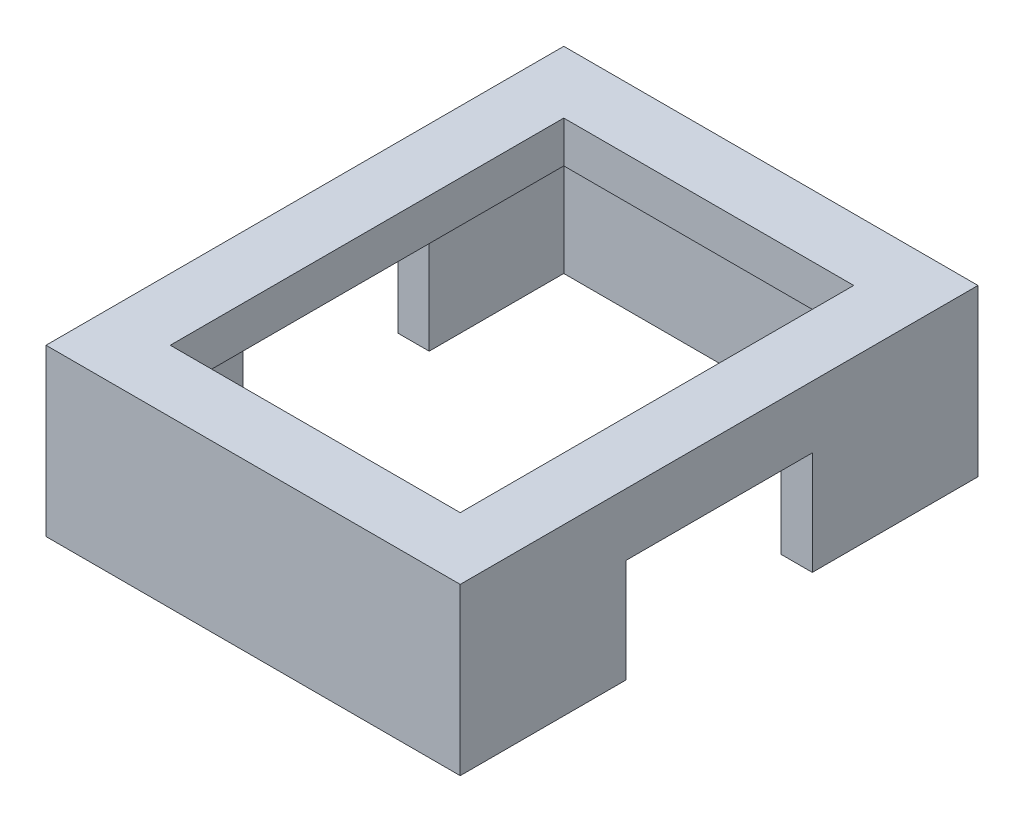
ISO-10303-21;
HEADER;
FILE_DESCRIPTION(('STEP AP214'),'2;1');
FILE_NAME('part.step','',(''),(''),'','','');
FILE_SCHEMA(('AUTOMOTIVE_DESIGN { 1 0 10303 214 1 1 1 1 }'));
ENDSEC;
DATA;
#1=APPLICATION_CONTEXT('core data for automotive mechanical design processes');
#2=APPLICATION_PROTOCOL_DEFINITION('international standard','automotive_design',2000,#1);
#3=PRODUCT_CONTEXT('',#1,'mechanical');
#4=PRODUCT('Part','Part','',(#3));
#5=PRODUCT_RELATED_PRODUCT_CATEGORY('part','',(#4));
#6=PRODUCT_DEFINITION_FORMATION('','',#4);
#7=PRODUCT_DEFINITION_CONTEXT('part definition',#1,'design');
#8=PRODUCT_DEFINITION('design','',#6,#7);
#9=PRODUCT_DEFINITION_SHAPE('','',#8);
#10=(LENGTH_UNIT() NAMED_UNIT(*) SI_UNIT(.MILLI.,.METRE.));
#11=(NAMED_UNIT(*) PLANE_ANGLE_UNIT() SI_UNIT($,.RADIAN.));
#12=(NAMED_UNIT(*) SI_UNIT($,.STERADIAN.) SOLID_ANGLE_UNIT());
#13=UNCERTAINTY_MEASURE_WITH_UNIT(LENGTH_MEASURE(1.E-05),#10,'distance_accuracy_value','');
#14=(GEOMETRIC_REPRESENTATION_CONTEXT(3) GLOBAL_UNCERTAINTY_ASSIGNED_CONTEXT((#13)) GLOBAL_UNIT_ASSIGNED_CONTEXT((#10,
#11,#12)) REPRESENTATION_CONTEXT('',''));
#15=CARTESIAN_POINT('',(0.,0.,0.));
#16=DIRECTION('',(0.,0.,1.));
#17=DIRECTION('',(1.,0.,0.));
#18=AXIS2_PLACEMENT_3D('',#15,#16,#17);
#19=CARTESIAN_POINT('',(10.0967741935484,5.,-1.87096774193549));
#20=DIRECTION('',(0.,1.,0.));
#21=DIRECTION('',(0.,0.,1.));
#22=AXIS2_PLACEMENT_3D('',#19,#20,#21);
#23=PLANE('',#22);
#24=DIRECTION('',(-1.,0.,0.));
#25=VECTOR('',#24,1.);
#26=CARTESIAN_POINT('',(10.0967741935484,5.,7.12903225806451));
#27=LINE('',#26,#25);
#28=CARTESIAN_POINT('',(-0.903225806451616,5.,7.12903225806451));
#29=VERTEX_POINT('',#28);
#30=CARTESIAN_POINT('',(-2.40322580645161,5.,7.12903225806451));
#31=VERTEX_POINT('',#30);
#32=EDGE_CURVE('E292',#29,#31,#27,.T.);
#33=ORIENTED_EDGE('',*,*,#32,.T.);
#34=DIRECTION('',(0.,0.,-1.));
#35=VECTOR('',#34,1.);
#36=CARTESIAN_POINT('',(-2.40322580645161,5.,-1.87096774193549));
#37=LINE('',#36,#35);
#38=CARTESIAN_POINT('',(-2.40322580645161,5.,-1.87096774193549));
#39=VERTEX_POINT('',#38);
#40=EDGE_CURVE('E265',#31,#39,#37,.T.);
#41=ORIENTED_EDGE('',*,*,#40,.T.);
#42=DIRECTION('',(-1.,0.,0.));
#43=VECTOR('',#42,1.);
#44=CARTESIAN_POINT('',(10.0967741935484,5.,-1.87096774193549));
#45=LINE('',#44,#43);
#46=CARTESIAN_POINT('',(-0.903225806451616,5.,-1.87096774193549));
#47=VERTEX_POINT('',#46);
#48=EDGE_CURVE('E286',#47,#39,#45,.T.);
#49=ORIENTED_EDGE('',*,*,#48,.F.);
#50=DIRECTION('',(0.,0.,-1.));
#51=VECTOR('',#50,1.);
#52=CARTESIAN_POINT('',(-0.903225806451618,5.,-9.87096774193548));
#53=LINE('',#52,#51);
#54=EDGE_CURVE('E358',#29,#47,#53,.T.);
#55=ORIENTED_EDGE('',*,*,#54,.F.);
#56=EDGE_LOOP('',(#33,#41,#49,#55));
#57=FACE_BOUND('',#56,.T.);
#58=ADVANCED_FACE('F39',(#57),#23,.F.);
#59=CARTESIAN_POINT('',(10.0967741935484,5.,-1.87096774193549));
#60=DIRECTION('',(0.,0.,-1.));
#61=DIRECTION('',(-1.,0.,0.));
#62=AXIS2_PLACEMENT_3D('',#59,#60,#61);
#63=PLANE('',#62);
#64=ORIENTED_EDGE('',*,*,#48,.T.);
#65=DIRECTION('',(0.,-1.,0.));
#66=VECTOR('',#65,1.);
#67=CARTESIAN_POINT('',(-2.40322580645161,5.,-1.87096774193549));
#68=LINE('',#67,#66);
#69=CARTESIAN_POINT('',(-2.40322580645161,0.,-1.87096774193548));
#70=VERTEX_POINT('',#69);
#71=EDGE_CURVE('E269',#39,#70,#68,.T.);
#72=ORIENTED_EDGE('',*,*,#71,.T.);
#73=DIRECTION('',(-1.,0.,0.));
#74=VECTOR('',#73,1.);
#75=CARTESIAN_POINT('',(0.,0.,-1.87096774193549));
#76=LINE('',#75,#74);
#77=CARTESIAN_POINT('',(-0.903225806451614,0.,-1.87096774193549));
#78=VERTEX_POINT('',#77);
#79=EDGE_CURVE('E354',#78,#70,#76,.T.);
#80=ORIENTED_EDGE('',*,*,#79,.F.);
#81=DIRECTION('',(0.,-1.,0.));
#82=VECTOR('',#81,1.);
#83=CARTESIAN_POINT('',(-0.903225806451617,8.,-1.87096774193548));
#84=LINE('',#83,#82);
#85=EDGE_CURVE('E299',#47,#78,#84,.T.);
#86=ORIENTED_EDGE('',*,*,#85,.F.);
#87=EDGE_LOOP('',(#64,#72,#80,#86));
#88=FACE_BOUND('',#87,.T.);
#89=ADVANCED_FACE('F396',(#88),#63,.F.);
#90=CARTESIAN_POINT('',(10.0967741935484,5.,7.12903225806451));
#91=DIRECTION('',(0.,0.,1.));
#92=DIRECTION('',(0.,-1.,0.));
#93=AXIS2_PLACEMENT_3D('',#90,#91,#92);
#94=PLANE('',#93);
#95=DIRECTION('',(1.,0.,0.));
#96=VECTOR('',#95,1.);
#97=CARTESIAN_POINT('',(0.,0.,7.12903225806451));
#98=LINE('',#97,#96);
#99=CARTESIAN_POINT('',(-2.40322580645161,0.,7.12903225806451));
#100=VERTEX_POINT('',#99);
#101=CARTESIAN_POINT('',(-0.903225806451616,0.,7.12903225806451));
#102=VERTEX_POINT('',#101);
#103=EDGE_CURVE('E348',#100,#102,#98,.T.);
#104=ORIENTED_EDGE('',*,*,#103,.F.);
#105=DIRECTION('',(0.,1.,0.));
#106=VECTOR('',#105,1.);
#107=CARTESIAN_POINT('',(-2.40322580645161,5.,7.12903225806451));
#108=LINE('',#107,#106);
#109=EDGE_CURVE('E366',#100,#31,#108,.T.);
#110=ORIENTED_EDGE('',*,*,#109,.T.);
#111=ORIENTED_EDGE('',*,*,#32,.F.);
#112=DIRECTION('',(0.,1.,0.));
#113=VECTOR('',#112,1.);
#114=CARTESIAN_POINT('',(-0.903225806451616,7.99999999999999,7.12903225806451));
#115=LINE('',#114,#113);
#116=EDGE_CURVE('E290',#102,#29,#115,.T.);
#117=ORIENTED_EDGE('',*,*,#116,.F.);
#118=EDGE_LOOP('',(#104,#110,#111,#117));
#119=FACE_BOUND('',#118,.T.);
#120=ADVANCED_FACE('F403',(#119),#94,.F.);
#121=CARTESIAN_POINT('',(0.,0.,0.));
#122=DIRECTION('',(0.,1.,0.));
#123=DIRECTION('',(0.,0.,1.));
#124=AXIS2_PLACEMENT_3D('',#121,#122,#123);
#125=PLANE('',#124);
#126=ORIENTED_EDGE('',*,*,#79,.T.);
#127=DIRECTION('',(0.,0.,1.));
#128=VECTOR('',#127,1.);
#129=CARTESIAN_POINT('',(-2.40322580645161,0.,-8.37096774193548));
#130=LINE('',#129,#128);
#131=CARTESIAN_POINT('',(-2.40322580645161,0.,-8.37096774193548));
#132=VERTEX_POINT('',#131);
#133=EDGE_CURVE('E230',#132,#70,#130,.T.);
#134=ORIENTED_EDGE('',*,*,#133,.F.);
#135=DIRECTION('',(1.,0.,0.));
#136=VECTOR('',#135,1.);
#137=CARTESIAN_POINT('',(-2.40322580645161,0.,-8.37096774193548));
#138=LINE('',#137,#136);
#139=CARTESIAN_POINT('',(-19.4032258064516,0.,-8.37096774193549));
#140=VERTEX_POINT('',#139);
#141=EDGE_CURVE('E217',#140,#132,#138,.T.);
#142=ORIENTED_EDGE('',*,*,#141,.F.);
#143=DIRECTION('',(0.,0.,-1.));
#144=VECTOR('',#143,1.);
#145=CARTESIAN_POINT('',(-19.4032258064516,0.,-8.37096774193549));
#146=LINE('',#145,#144);
#147=CARTESIAN_POINT('',(-19.4032258064516,0.,-1.87096774193548));
#148=VERTEX_POINT('',#147);
#149=EDGE_CURVE('E237',#148,#140,#146,.T.);
#150=ORIENTED_EDGE('',*,*,#149,.F.);
#151=CARTESIAN_POINT('',(-20.9032258064516,0.,-1.87096774193548));
#152=VERTEX_POINT('',#151);
#153=EDGE_CURVE('E353',#148,#152,#76,.T.);
#154=ORIENTED_EDGE('',*,*,#153,.T.);
#155=DIRECTION('',(0.,0.,1.));
#156=VECTOR('',#155,1.);
#157=CARTESIAN_POINT('',(-20.9032258064516,0.,-9.87096774193548));
#158=LINE('',#157,#156);
#159=CARTESIAN_POINT('',(-20.9032258064516,0.,-9.87096774193548));
#160=VERTEX_POINT('',#159);
#161=EDGE_CURVE('E319',#160,#152,#158,.T.);
#162=ORIENTED_EDGE('',*,*,#161,.F.);
#163=DIRECTION('',(-1.,0.,0.));
#164=VECTOR('',#163,1.);
#165=CARTESIAN_POINT('',(-20.9032258064516,0.,-9.87096774193548));
#166=LINE('',#165,#164);
#167=CARTESIAN_POINT('',(-0.903225806451618,0.,-9.87096774193548));
#168=VERTEX_POINT('',#167);
#169=EDGE_CURVE('E309',#168,#160,#166,.T.);
#170=ORIENTED_EDGE('',*,*,#169,.F.);
#171=DIRECTION('',(0.,0.,-1.));
#172=VECTOR('',#171,1.);
#173=CARTESIAN_POINT('',(-0.903225806451618,0.,-9.87096774193548));
#174=LINE('',#173,#172);
#175=EDGE_CURVE('E326',#78,#168,#174,.T.);
#176=ORIENTED_EDGE('',*,*,#175,.F.);
#177=EDGE_LOOP('',(#126,#134,#142,#150,#154,#162,#170,#176));
#178=FACE_BOUND('',#177,.T.);
#179=ADVANCED_FACE('F420',(#178),#125,.F.);
#180=CARTESIAN_POINT('',(-20.9032258064516,8.,-9.87096774193548));
#181=DIRECTION('',(1.,0.,0.));
#182=DIRECTION('',(0.,0.,-1.));
#183=AXIS2_PLACEMENT_3D('',#180,#181,#182);
#184=PLANE('',#183);
#185=ORIENTED_EDGE('',*,*,#161,.T.);
#186=DIRECTION('',(0.,-1.,0.));
#187=VECTOR('',#186,1.);
#188=CARTESIAN_POINT('',(-20.9032258064516,5.,-1.87096774193548));
#189=LINE('',#188,#187);
#190=CARTESIAN_POINT('',(-20.9032258064516,5.,-1.87096774193548));
#191=VERTEX_POINT('',#190);
#192=EDGE_CURVE('E273',#191,#152,#189,.T.);
#193=ORIENTED_EDGE('',*,*,#192,.F.);
#194=DIRECTION('',(0.,0.,-1.));
#195=VECTOR('',#194,1.);
#196=CARTESIAN_POINT('',(-20.9032258064516,5.,-1.87096774193548));
#197=LINE('',#196,#195);
#198=CARTESIAN_POINT('',(-20.9032258064516,5.,7.12903225806452));
#199=VERTEX_POINT('',#198);
#200=EDGE_CURVE('E281',#199,#191,#197,.T.);
#201=ORIENTED_EDGE('',*,*,#200,.F.);
#202=DIRECTION('',(0.,1.,0.));
#203=VECTOR('',#202,1.);
#204=CARTESIAN_POINT('',(-20.9032258064516,5.,7.12903225806452));
#205=LINE('',#204,#203);
#206=CARTESIAN_POINT('',(-20.9032258064516,0.,7.12903225806451));
#207=VERTEX_POINT('',#206);
#208=EDGE_CURVE('E277',#207,#199,#205,.T.);
#209=ORIENTED_EDGE('',*,*,#208,.F.);
#210=CARTESIAN_POINT('',(-20.9032258064516,0.,15.1290322580645));
#211=VERTEX_POINT('',#210);
#212=EDGE_CURVE('E303',#207,#211,#158,.T.);
#213=ORIENTED_EDGE('',*,*,#212,.T.);
#214=DIRECTION('',(0.,-1.,0.));
#215=VECTOR('',#214,1.);
#216=CARTESIAN_POINT('',(-20.9032258064516,8.,15.1290322580645));
#217=LINE('',#216,#215);
#218=CARTESIAN_POINT('',(-20.9032258064516,8.,15.1290322580645));
#219=VERTEX_POINT('',#218);
#220=EDGE_CURVE('E344',#219,#211,#217,.T.);
#221=ORIENTED_EDGE('',*,*,#220,.F.);
#222=DIRECTION('',(0.,0.,1.));
#223=VECTOR('',#222,1.);
#224=CARTESIAN_POINT('',(-20.9032258064516,8.,-9.87096774193548));
#225=LINE('',#224,#223);
#226=CARTESIAN_POINT('',(-20.9032258064516,8.,-9.87096774193548));
#227=VERTEX_POINT('',#226);
#228=EDGE_CURVE('E304',#227,#219,#225,.T.);
#229=ORIENTED_EDGE('',*,*,#228,.F.);
#230=DIRECTION('',(0.,-1.,0.));
#231=VECTOR('',#230,1.);
#232=CARTESIAN_POINT('',(-20.9032258064516,8.,-9.87096774193548));
#233=LINE('',#232,#231);
#234=EDGE_CURVE('E318',#227,#160,#233,.T.);
#235=ORIENTED_EDGE('',*,*,#234,.T.);
#236=EDGE_LOOP('',(#185,#193,#201,#209,#213,#221,#229,#235));
#237=FACE_BOUND('',#236,.T.);
#238=ADVANCED_FACE('F41',(#237),#184,.F.);
#239=CARTESIAN_POINT('',(-20.9032258064516,8.,15.1290322580645));
#240=DIRECTION('',(0.,0.,-1.));
#241=DIRECTION('',(-1.,0.,0.));
#242=AXIS2_PLACEMENT_3D('',#239,#240,#241);
#243=PLANE('',#242);
#244=DIRECTION('',(1.,0.,0.));
#245=VECTOR('',#244,1.);
#246=CARTESIAN_POINT('',(-20.9032258064516,0.,15.1290322580645));
#247=LINE('',#246,#245);
#248=CARTESIAN_POINT('',(-0.903225806451615,0.,15.1290322580645));
#249=VERTEX_POINT('',#248);
#250=EDGE_CURVE('E323',#211,#249,#247,.T.);
#251=ORIENTED_EDGE('',*,*,#250,.T.);
#252=DIRECTION('',(0.,-1.,0.));
#253=VECTOR('',#252,1.);
#254=CARTESIAN_POINT('',(-0.903225806451615,8.,15.1290322580645));
#255=LINE('',#254,#253);
#256=CARTESIAN_POINT('',(-0.903225806451615,8.,15.1290322580645));
#257=VERTEX_POINT('',#256);
#258=EDGE_CURVE('E340',#257,#249,#255,.T.);
#259=ORIENTED_EDGE('',*,*,#258,.F.);
#260=DIRECTION('',(1.,0.,0.));
#261=VECTOR('',#260,1.);
#262=CARTESIAN_POINT('',(-20.9032258064516,8.,15.1290322580645));
#263=LINE('',#262,#261);
#264=EDGE_CURVE('E308',#219,#257,#263,.T.);
#265=ORIENTED_EDGE('',*,*,#264,.F.);
#266=ORIENTED_EDGE('',*,*,#220,.T.);
#267=EDGE_LOOP('',(#251,#259,#265,#266));
#268=FACE_BOUND('',#267,.T.);
#269=ADVANCED_FACE('F459',(#268),#243,.F.);
#270=CARTESIAN_POINT('',(-0.903225806451618,8.,-9.87096774193548));
#271=DIRECTION('',(-1.,0.,0.));
#272=DIRECTION('',(0.,0.,1.));
#273=AXIS2_PLACEMENT_3D('',#270,#271,#272);
#274=PLANE('',#273);
#275=ORIENTED_EDGE('',*,*,#54,.T.);
#276=ORIENTED_EDGE('',*,*,#85,.T.);
#277=ORIENTED_EDGE('',*,*,#175,.T.);
#278=DIRECTION('',(0.,-1.,0.));
#279=VECTOR('',#278,1.);
#280=CARTESIAN_POINT('',(-0.903225806451618,8.,-9.87096774193548));
#281=LINE('',#280,#279);
#282=CARTESIAN_POINT('',(-0.903225806451618,8.,-9.87096774193548));
#283=VERTEX_POINT('',#282);
#284=EDGE_CURVE('E336',#283,#168,#281,.T.);
#285=ORIENTED_EDGE('',*,*,#284,.F.);
#286=DIRECTION('',(0.,0.,-1.));
#287=VECTOR('',#286,1.);
#288=CARTESIAN_POINT('',(-0.903225806451618,8.,-9.87096774193548));
#289=LINE('',#288,#287);
#290=EDGE_CURVE('E312',#257,#283,#289,.T.);
#291=ORIENTED_EDGE('',*,*,#290,.F.);
#292=ORIENTED_EDGE('',*,*,#258,.T.);
#293=EDGE_CURVE('E327',#249,#102,#174,.T.);
#294=ORIENTED_EDGE('',*,*,#293,.T.);
#295=ORIENTED_EDGE('',*,*,#116,.T.);
#296=EDGE_LOOP('',(#275,#276,#277,#285,#291,#292,#294,#295));
#297=FACE_BOUND('',#296,.T.);
#298=ADVANCED_FACE('F469',(#297),#274,.F.);
#299=CARTESIAN_POINT('',(-20.9032258064516,8.,-9.87096774193548));
#300=DIRECTION('',(0.,0.,1.));
#301=DIRECTION('',(1.,0.,0.));
#302=AXIS2_PLACEMENT_3D('',#299,#300,#301);
#303=PLANE('',#302);
#304=ORIENTED_EDGE('',*,*,#169,.T.);
#305=ORIENTED_EDGE('',*,*,#234,.F.);
#306=DIRECTION('',(-1.,0.,0.));
#307=VECTOR('',#306,1.);
#308=CARTESIAN_POINT('',(-20.9032258064516,8.,-9.87096774193548));
#309=LINE('',#308,#307);
#310=EDGE_CURVE('E315',#283,#227,#309,.T.);
#311=ORIENTED_EDGE('',*,*,#310,.F.);
#312=ORIENTED_EDGE('',*,*,#284,.T.);
#313=EDGE_LOOP('',(#304,#305,#311,#312));
#314=FACE_BOUND('',#313,.T.);
#315=ADVANCED_FACE('F466',(#314),#303,.F.);
#316=CARTESIAN_POINT('',(0.,8.,0.));
#317=DIRECTION('',(0.,1.,0.));
#318=DIRECTION('',(0.,0.,1.));
#319=AXIS2_PLACEMENT_3D('',#316,#317,#318);
#320=PLANE('',#319);
#321=DIRECTION('',(0.,0.,1.));
#322=VECTOR('',#321,1.);
#323=CARTESIAN_POINT('',(-17.9032258064516,8.,-6.87096774193548));
#324=LINE('',#323,#322);
#325=CARTESIAN_POINT('',(-17.9032258064516,8.,-6.87096774193548));
#326=VERTEX_POINT('',#325);
#327=CARTESIAN_POINT('',(-17.9032258064516,8.,12.1290322580645));
#328=VERTEX_POINT('',#327);
#329=EDGE_CURVE('E55',#326,#328,#324,.T.);
#330=ORIENTED_EDGE('',*,*,#329,.F.);
#331=DIRECTION('',(-1.,0.,0.));
#332=VECTOR('',#331,1.);
#333=CARTESIAN_POINT('',(-17.9032258064516,8.,-6.87096774193548));
#334=LINE('',#333,#332);
#335=CARTESIAN_POINT('',(-3.90322580645162,8.,-6.87096774193548));
#336=VERTEX_POINT('',#335);
#337=EDGE_CURVE('E197',#336,#326,#334,.T.);
#338=ORIENTED_EDGE('',*,*,#337,.F.);
#339=DIRECTION('',(0.,0.,-1.));
#340=VECTOR('',#339,1.);
#341=CARTESIAN_POINT('',(-3.90322580645162,8.,-6.87096774193548));
#342=LINE('',#341,#340);
#343=CARTESIAN_POINT('',(-3.90322580645161,8.,12.1290322580645));
#344=VERTEX_POINT('',#343);
#345=EDGE_CURVE('E179',#344,#336,#342,.T.);
#346=ORIENTED_EDGE('',*,*,#345,.F.);
#347=DIRECTION('',(1.,0.,0.));
#348=VECTOR('',#347,1.);
#349=CARTESIAN_POINT('',(-17.9032258064516,8.,12.1290322580645));
#350=LINE('',#349,#348);
#351=EDGE_CURVE('E189',#328,#344,#350,.T.);
#352=ORIENTED_EDGE('',*,*,#351,.F.);
#353=EDGE_LOOP('',(#330,#338,#346,#352));
#354=FACE_BOUND('',#353,.T.);
#355=ORIENTED_EDGE('',*,*,#228,.T.);
#356=ORIENTED_EDGE('',*,*,#264,.T.);
#357=ORIENTED_EDGE('',*,*,#290,.T.);
#358=ORIENTED_EDGE('',*,*,#310,.T.);
#359=EDGE_LOOP('',(#355,#356,#357,#358));
#360=FACE_BOUND('',#359,.T.);
#361=ADVANCED_FACE('F194',(#354,#360),#320,.T.);
#362=DIRECTION('',(-1.,0.,0.));
#363=VECTOR('',#362,1.);
#364=CARTESIAN_POINT('',(-2.40322580645161,0.,13.6290322580645));
#365=LINE('',#364,#363);
#366=CARTESIAN_POINT('',(-2.40322580645161,0.,13.6290322580645));
#367=VERTEX_POINT('',#366);
#368=CARTESIAN_POINT('',(-19.4032258064516,0.,13.6290322580645));
#369=VERTEX_POINT('',#368);
#370=EDGE_CURVE('E233',#367,#369,#365,.T.);
#371=ORIENTED_EDGE('',*,*,#370,.F.);
#372=EDGE_CURVE('E207',#100,#367,#130,.T.);
#373=ORIENTED_EDGE('',*,*,#372,.F.);
#374=ORIENTED_EDGE('',*,*,#103,.T.);
#375=ORIENTED_EDGE('',*,*,#293,.F.);
#376=ORIENTED_EDGE('',*,*,#250,.F.);
#377=ORIENTED_EDGE('',*,*,#212,.F.);
#378=CARTESIAN_POINT('',(-19.4032258064516,0.,7.12903225806451));
#379=VERTEX_POINT('',#378);
#380=EDGE_CURVE('E349',#207,#379,#98,.T.);
#381=ORIENTED_EDGE('',*,*,#380,.T.);
#382=EDGE_CURVE('E238',#369,#379,#146,.T.);
#383=ORIENTED_EDGE('',*,*,#382,.F.);
#384=EDGE_LOOP('',(#371,#373,#374,#375,#376,#377,#381,#383));
#385=FACE_BOUND('',#384,.T.);
#386=ADVANCED_FACE('F410',(#385),#125,.F.);
#387=CARTESIAN_POINT('',(-19.4032258064516,5.,-1.87096774193549));
#388=VERTEX_POINT('',#387);
#389=EDGE_CURVE('E291',#388,#191,#45,.T.);
#390=ORIENTED_EDGE('',*,*,#389,.F.);
#391=DIRECTION('',(0.,0.,1.));
#392=VECTOR('',#391,1.);
#393=CARTESIAN_POINT('',(-19.4032258064516,5.,-1.87096774193549));
#394=LINE('',#393,#392);
#395=CARTESIAN_POINT('',(-19.4032258064516,5.,7.12903225806451));
#396=VERTEX_POINT('',#395);
#397=EDGE_CURVE('E247',#388,#396,#394,.T.);
#398=ORIENTED_EDGE('',*,*,#397,.T.);
#399=EDGE_CURVE('E285',#396,#199,#27,.T.);
#400=ORIENTED_EDGE('',*,*,#399,.T.);
#401=ORIENTED_EDGE('',*,*,#200,.T.);
#402=EDGE_LOOP('',(#390,#398,#400,#401));
#403=FACE_BOUND('',#402,.T.);
#404=ADVANCED_FACE('F399',(#403),#23,.F.);
#405=ORIENTED_EDGE('',*,*,#153,.F.);
#406=DIRECTION('',(0.,1.,0.));
#407=VECTOR('',#406,1.);
#408=CARTESIAN_POINT('',(-19.4032258064516,5.,-1.87096774193548));
#409=LINE('',#408,#407);
#410=EDGE_CURVE('E261',#148,#388,#409,.T.);
#411=ORIENTED_EDGE('',*,*,#410,.T.);
#412=ORIENTED_EDGE('',*,*,#389,.T.);
#413=ORIENTED_EDGE('',*,*,#192,.T.);
#414=EDGE_LOOP('',(#405,#411,#412,#413));
#415=FACE_BOUND('',#414,.T.);
#416=ADVANCED_FACE('F406',(#415),#63,.F.);
#417=ORIENTED_EDGE('',*,*,#399,.F.);
#418=DIRECTION('',(0.,-1.,0.));
#419=VECTOR('',#418,1.);
#420=CARTESIAN_POINT('',(-19.4032258064516,5.,7.12903225806451));
#421=LINE('',#420,#419);
#422=EDGE_CURVE('E362',#396,#379,#421,.T.);
#423=ORIENTED_EDGE('',*,*,#422,.T.);
#424=ORIENTED_EDGE('',*,*,#380,.F.);
#425=ORIENTED_EDGE('',*,*,#208,.T.);
#426=EDGE_LOOP('',(#417,#423,#424,#425));
#427=FACE_BOUND('',#426,.T.);
#428=ADVANCED_FACE('F416',(#427),#94,.F.);
#429=CARTESIAN_POINT('',(-2.40322580645161,6.,-8.37096774193548));
#430=DIRECTION('',(1.,0.,0.));
#431=DIRECTION('',(0.,0.,-1.));
#432=AXIS2_PLACEMENT_3D('',#429,#430,#431);
#433=PLANE('',#432);
#434=ORIENTED_EDGE('',*,*,#40,.F.);
#435=ORIENTED_EDGE('',*,*,#109,.F.);
#436=ORIENTED_EDGE('',*,*,#372,.T.);
#437=DIRECTION('',(0.,-1.,0.));
#438=VECTOR('',#437,1.);
#439=CARTESIAN_POINT('',(-2.40322580645161,6.,13.6290322580645));
#440=LINE('',#439,#438);
#441=CARTESIAN_POINT('',(-2.40322580645161,6.,13.6290322580645));
#442=VERTEX_POINT('',#441);
#443=EDGE_CURVE('E229',#442,#367,#440,.T.);
#444=ORIENTED_EDGE('',*,*,#443,.F.);
#445=DIRECTION('',(0.,0.,1.));
#446=VECTOR('',#445,1.);
#447=CARTESIAN_POINT('',(-2.40322580645161,6.,-8.37096774193548));
#448=LINE('',#447,#446);
#449=CARTESIAN_POINT('',(-2.40322580645161,6.,-8.37096774193548));
#450=VERTEX_POINT('',#449);
#451=EDGE_CURVE('E212',#450,#442,#448,.T.);
#452=ORIENTED_EDGE('',*,*,#451,.F.);
#453=DIRECTION('',(0.,-1.,0.));
#454=VECTOR('',#453,1.);
#455=CARTESIAN_POINT('',(-2.40322580645161,6.,-8.37096774193548));
#456=LINE('',#455,#454);
#457=EDGE_CURVE('E244',#450,#132,#456,.T.);
#458=ORIENTED_EDGE('',*,*,#457,.T.);
#459=ORIENTED_EDGE('',*,*,#133,.T.);
#460=ORIENTED_EDGE('',*,*,#71,.F.);
#461=EDGE_LOOP('',(#434,#435,#436,#444,#452,#458,#459,#460));
#462=FACE_BOUND('',#461,.T.);
#463=ADVANCED_FACE('F431',(#462),#433,.F.);
#464=CARTESIAN_POINT('',(-19.4032258064516,6.,-8.37096774193549));
#465=DIRECTION('',(-1.,0.,0.));
#466=DIRECTION('',(0.,0.,1.));
#467=AXIS2_PLACEMENT_3D('',#464,#465,#466);
#468=PLANE('',#467);
#469=ORIENTED_EDGE('',*,*,#149,.T.);
#470=DIRECTION('',(0.,-1.,0.));
#471=VECTOR('',#470,1.);
#472=CARTESIAN_POINT('',(-19.4032258064516,6.,-8.37096774193549));
#473=LINE('',#472,#471);
#474=CARTESIAN_POINT('',(-19.4032258064516,6.,-8.37096774193549));
#475=VERTEX_POINT('',#474);
#476=EDGE_CURVE('E248',#475,#140,#473,.T.);
#477=ORIENTED_EDGE('',*,*,#476,.F.);
#478=DIRECTION('',(0.,0.,-1.));
#479=VECTOR('',#478,1.);
#480=CARTESIAN_POINT('',(-19.4032258064516,6.,-8.37096774193549));
#481=LINE('',#480,#479);
#482=CARTESIAN_POINT('',(-19.4032258064516,6.,13.6290322580645));
#483=VERTEX_POINT('',#482);
#484=EDGE_CURVE('E221',#483,#475,#481,.T.);
#485=ORIENTED_EDGE('',*,*,#484,.F.);
#486=DIRECTION('',(0.,-1.,0.));
#487=VECTOR('',#486,1.);
#488=CARTESIAN_POINT('',(-19.4032258064516,6.,13.6290322580645));
#489=LINE('',#488,#487);
#490=EDGE_CURVE('E252',#483,#369,#489,.T.);
#491=ORIENTED_EDGE('',*,*,#490,.T.);
#492=ORIENTED_EDGE('',*,*,#382,.T.);
#493=ORIENTED_EDGE('',*,*,#422,.F.);
#494=ORIENTED_EDGE('',*,*,#397,.F.);
#495=ORIENTED_EDGE('',*,*,#410,.F.);
#496=EDGE_LOOP('',(#469,#477,#485,#491,#492,#493,#494,#495));
#497=FACE_BOUND('',#496,.T.);
#498=ADVANCED_FACE('F440',(#497),#468,.F.);
#499=CARTESIAN_POINT('',(-2.40322580645161,6.,-8.37096774193548));
#500=DIRECTION('',(0.,0.,-1.));
#501=DIRECTION('',(-1.,0.,0.));
#502=AXIS2_PLACEMENT_3D('',#499,#500,#501);
#503=PLANE('',#502);
#504=ORIENTED_EDGE('',*,*,#141,.T.);
#505=ORIENTED_EDGE('',*,*,#457,.F.);
#506=DIRECTION('',(1.,0.,0.));
#507=VECTOR('',#506,1.);
#508=CARTESIAN_POINT('',(-2.40322580645161,6.,-8.37096774193548));
#509=LINE('',#508,#507);
#510=EDGE_CURVE('E225',#475,#450,#509,.T.);
#511=ORIENTED_EDGE('',*,*,#510,.F.);
#512=ORIENTED_EDGE('',*,*,#476,.T.);
#513=EDGE_LOOP('',(#504,#505,#511,#512));
#514=FACE_BOUND('',#513,.T.);
#515=ADVANCED_FACE('F485',(#514),#503,.F.);
#516=CARTESIAN_POINT('',(-2.40322580645161,6.,13.6290322580645));
#517=DIRECTION('',(0.,0.,1.));
#518=DIRECTION('',(1.,0.,0.));
#519=AXIS2_PLACEMENT_3D('',#516,#517,#518);
#520=PLANE('',#519);
#521=ORIENTED_EDGE('',*,*,#370,.T.);
#522=ORIENTED_EDGE('',*,*,#490,.F.);
#523=DIRECTION('',(-1.,0.,0.));
#524=VECTOR('',#523,1.);
#525=CARTESIAN_POINT('',(-2.40322580645161,6.,13.6290322580645));
#526=LINE('',#525,#524);
#527=EDGE_CURVE('E216',#442,#483,#526,.T.);
#528=ORIENTED_EDGE('',*,*,#527,.F.);
#529=ORIENTED_EDGE('',*,*,#443,.T.);
#530=EDGE_LOOP('',(#521,#522,#528,#529));
#531=FACE_BOUND('',#530,.T.);
#532=ADVANCED_FACE('F392',(#531),#520,.F.);
#533=CARTESIAN_POINT('',(0.,6.,0.));
#534=DIRECTION('',(0.,-1.,0.));
#535=DIRECTION('',(0.,0.,-1.));
#536=AXIS2_PLACEMENT_3D('',#533,#534,#535);
#537=PLANE('',#536);
#538=DIRECTION('',(0.,0.,-1.));
#539=VECTOR('',#538,1.);
#540=CARTESIAN_POINT('',(-17.9032258064516,6.,0.));
#541=LINE('',#540,#539);
#542=CARTESIAN_POINT('',(-17.9032258064516,6.,12.1290322580645));
#543=VERTEX_POINT('',#542);
#544=CARTESIAN_POINT('',(-17.9032258064516,6.,-6.87096774193548));
#545=VERTEX_POINT('',#544);
#546=EDGE_CURVE('E11',#543,#545,#541,.T.);
#547=ORIENTED_EDGE('',*,*,#546,.F.);
#548=DIRECTION('',(-1.,0.,0.));
#549=VECTOR('',#548,1.);
#550=CARTESIAN_POINT('',(0.,6.,12.1290322580645));
#551=LINE('',#550,#549);
#552=CARTESIAN_POINT('',(-3.90322580645161,6.,12.1290322580645));
#553=VERTEX_POINT('',#552);
#554=EDGE_CURVE('E370',#553,#543,#551,.T.);
#555=ORIENTED_EDGE('',*,*,#554,.F.);
#556=DIRECTION('',(0.,0.,1.));
#557=VECTOR('',#556,1.);
#558=CARTESIAN_POINT('',(-3.90322580645161,6.,0.));
#559=LINE('',#558,#557);
#560=CARTESIAN_POINT('',(-3.90322580645162,6.,-6.87096774193548));
#561=VERTEX_POINT('',#560);
#562=EDGE_CURVE('E182',#561,#553,#559,.T.);
#563=ORIENTED_EDGE('',*,*,#562,.F.);
#564=DIRECTION('',(1.,0.,0.));
#565=VECTOR('',#564,1.);
#566=CARTESIAN_POINT('',(0.,6.,-6.87096774193548));
#567=LINE('',#566,#565);
#568=EDGE_CURVE('E48',#545,#561,#567,.T.);
#569=ORIENTED_EDGE('',*,*,#568,.F.);
#570=EDGE_LOOP('',(#547,#555,#563,#569));
#571=FACE_BOUND('',#570,.T.);
#572=ORIENTED_EDGE('',*,*,#451,.T.);
#573=ORIENTED_EDGE('',*,*,#527,.T.);
#574=ORIENTED_EDGE('',*,*,#484,.T.);
#575=ORIENTED_EDGE('',*,*,#510,.T.);
#576=EDGE_LOOP('',(#572,#573,#574,#575));
#577=FACE_BOUND('',#576,.T.);
#578=ADVANCED_FACE('F381',(#571,#577),#537,.T.);
#579=CARTESIAN_POINT('',(-17.9032258064516,1.,-6.87096774193548));
#580=DIRECTION('',(-1.,0.,0.));
#581=DIRECTION('',(0.,0.,1.));
#582=AXIS2_PLACEMENT_3D('',#579,#580,#581);
#583=PLANE('',#582);
#584=ORIENTED_EDGE('',*,*,#546,.T.);
#585=DIRECTION('',(0.,1.,0.));
#586=VECTOR('',#585,1.);
#587=CARTESIAN_POINT('',(-17.9032258064516,1.,-6.87096774193548));
#588=LINE('',#587,#586);
#589=EDGE_CURVE('E204',#545,#326,#588,.T.);
#590=ORIENTED_EDGE('',*,*,#589,.T.);
#591=ORIENTED_EDGE('',*,*,#329,.T.);
#592=DIRECTION('',(0.,1.,0.));
#593=VECTOR('',#592,1.);
#594=CARTESIAN_POINT('',(-17.9032258064516,1.,12.1290322580645));
#595=LINE('',#594,#593);
#596=EDGE_CURVE('E186',#543,#328,#595,.T.);
#597=ORIENTED_EDGE('',*,*,#596,.F.);
#598=EDGE_LOOP('',(#584,#590,#591,#597));
#599=FACE_BOUND('',#598,.T.);
#600=ADVANCED_FACE('F383',(#599),#583,.F.);
#601=CARTESIAN_POINT('',(-17.9032258064516,1.,-6.87096774193548));
#602=DIRECTION('',(0.,0.,-1.));
#603=DIRECTION('',(-1.,0.,0.));
#604=AXIS2_PLACEMENT_3D('',#601,#602,#603);
#605=PLANE('',#604);
#606=ORIENTED_EDGE('',*,*,#568,.T.);
#607=DIRECTION('',(0.,1.,0.));
#608=VECTOR('',#607,1.);
#609=CARTESIAN_POINT('',(-3.90322580645162,1.,-6.87096774193548));
#610=LINE('',#609,#608);
#611=EDGE_CURVE('E185',#561,#336,#610,.T.);
#612=ORIENTED_EDGE('',*,*,#611,.T.);
#613=ORIENTED_EDGE('',*,*,#337,.T.);
#614=ORIENTED_EDGE('',*,*,#589,.F.);
#615=EDGE_LOOP('',(#606,#612,#613,#614));
#616=FACE_BOUND('',#615,.T.);
#617=ADVANCED_FACE('F378',(#616),#605,.F.);
#618=CARTESIAN_POINT('',(-3.90322580645162,1.,-6.87096774193548));
#619=DIRECTION('',(1.,0.,0.));
#620=DIRECTION('',(0.,0.,-1.));
#621=AXIS2_PLACEMENT_3D('',#618,#619,#620);
#622=PLANE('',#621);
#623=ORIENTED_EDGE('',*,*,#562,.T.);
#624=DIRECTION('',(0.,1.,0.));
#625=VECTOR('',#624,1.);
#626=CARTESIAN_POINT('',(-3.90322580645161,1.,12.1290322580645));
#627=LINE('',#626,#625);
#628=EDGE_CURVE('E63',#553,#344,#627,.T.);
#629=ORIENTED_EDGE('',*,*,#628,.T.);
#630=ORIENTED_EDGE('',*,*,#345,.T.);
#631=ORIENTED_EDGE('',*,*,#611,.F.);
#632=EDGE_LOOP('',(#623,#629,#630,#631));
#633=FACE_BOUND('',#632,.T.);
#634=ADVANCED_FACE('F176',(#633),#622,.F.);
#635=CARTESIAN_POINT('',(-17.9032258064516,1.,12.1290322580645));
#636=DIRECTION('',(0.,0.,1.));
#637=DIRECTION('',(1.,0.,0.));
#638=AXIS2_PLACEMENT_3D('',#635,#636,#637);
#639=PLANE('',#638);
#640=ORIENTED_EDGE('',*,*,#554,.T.);
#641=ORIENTED_EDGE('',*,*,#596,.T.);
#642=ORIENTED_EDGE('',*,*,#351,.T.);
#643=ORIENTED_EDGE('',*,*,#628,.F.);
#644=EDGE_LOOP('',(#640,#641,#642,#643));
#645=FACE_BOUND('',#644,.T.);
#646=ADVANCED_FACE('F190',(#645),#639,.F.);
#647=CLOSED_SHELL('',(#58,#89,#120,#179,#238,#269,#298,#315,#361,#386,#404,#416,#428,#463,#498,
#515,#532,#578,#600,#617,#634,#646));
#648=MANIFOLD_SOLID_BREP('B2',#647);
#649=ADVANCED_BREP_SHAPE_REPRESENTATION('',(#18,#648),#14);
#650=SHAPE_DEFINITION_REPRESENTATION(#9,#649);
ENDSEC;
END-ISO-10303-21;
